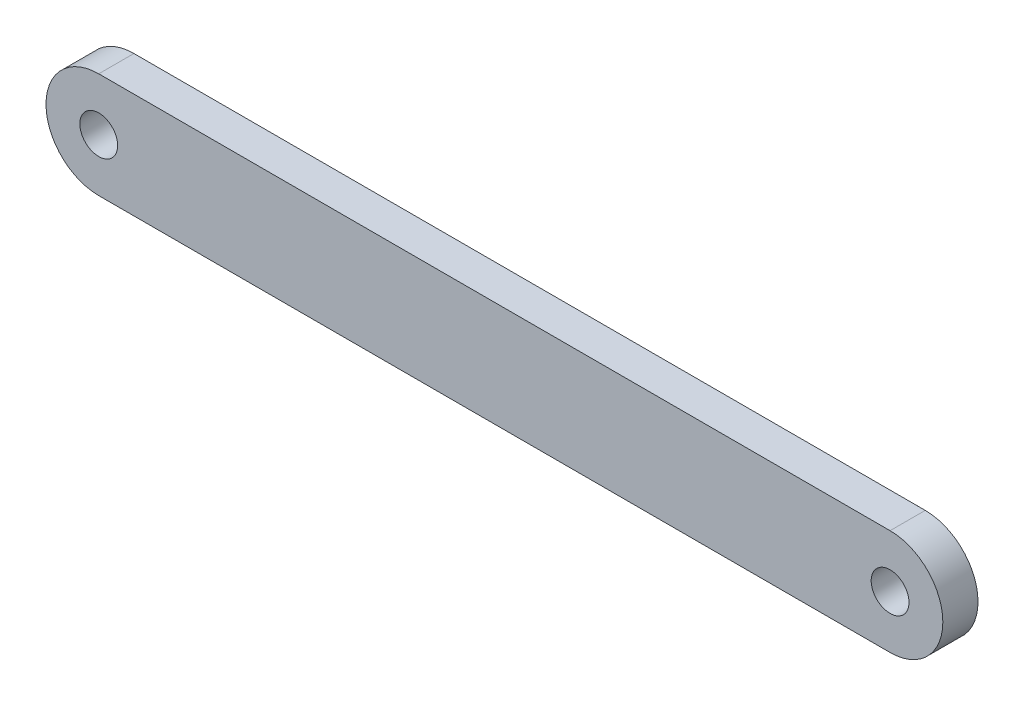
ISO-10303-21;
HEADER;
FILE_DESCRIPTION(('STEP AP214'),'2;1');
FILE_NAME('part.step','',(''),(''),'','','');
FILE_SCHEMA(('AUTOMOTIVE_DESIGN { 1 0 10303 214 1 1 1 1 }'));
ENDSEC;
DATA;
#1=APPLICATION_CONTEXT('core data for automotive mechanical design processes');
#2=APPLICATION_PROTOCOL_DEFINITION('international standard','automotive_design',2000,#1);
#3=PRODUCT_CONTEXT('',#1,'mechanical');
#4=PRODUCT('Part','Part','',(#3));
#5=PRODUCT_RELATED_PRODUCT_CATEGORY('part','',(#4));
#6=PRODUCT_DEFINITION_FORMATION('','',#4);
#7=PRODUCT_DEFINITION_CONTEXT('part definition',#1,'design');
#8=PRODUCT_DEFINITION('design','',#6,#7);
#9=PRODUCT_DEFINITION_SHAPE('','',#8);
#10=(LENGTH_UNIT() NAMED_UNIT(*) SI_UNIT(.MILLI.,.METRE.));
#11=(NAMED_UNIT(*) PLANE_ANGLE_UNIT() SI_UNIT($,.RADIAN.));
#12=(NAMED_UNIT(*) SI_UNIT($,.STERADIAN.) SOLID_ANGLE_UNIT());
#13=UNCERTAINTY_MEASURE_WITH_UNIT(LENGTH_MEASURE(1.E-05),#10,'distance_accuracy_value','');
#14=(GEOMETRIC_REPRESENTATION_CONTEXT(3) GLOBAL_UNCERTAINTY_ASSIGNED_CONTEXT((#13)) GLOBAL_UNIT_ASSIGNED_CONTEXT((#10,
#11,#12)) REPRESENTATION_CONTEXT('',''));
#15=CARTESIAN_POINT('',(0.,0.,0.));
#16=DIRECTION('',(0.,0.,1.));
#17=DIRECTION('',(1.,0.,0.));
#18=AXIS2_PLACEMENT_3D('',#15,#16,#17);
#19=CARTESIAN_POINT('',(0.,0.,4.));
#20=DIRECTION('',(0.,0.,1.));
#21=DIRECTION('',(1.,0.,0.));
#22=AXIS2_PLACEMENT_3D('',#19,#20,#21);
#23=PLANE('',#22);
#24=CARTESIAN_POINT('',(0.,0.,4.));
#25=DIRECTION('',(0.,0.,1.));
#26=DIRECTION('',(1.,0.,0.));
#27=AXIS2_PLACEMENT_3D('',#24,#25,#26);
#28=CIRCLE('',#27,2.15);
#29=CARTESIAN_POINT('',(2.15,0.,4.));
#30=VERTEX_POINT('',#29);
#31=EDGE_CURVE('E104',#30,#30,#28,.T.);
#32=ORIENTED_EDGE('',*,*,#31,.F.);
#33=EDGE_LOOP('',(#32));
#34=FACE_BOUND('',#33,.T.);
#35=CARTESIAN_POINT('',(0.,0.,4.));
#36=DIRECTION('',(0.,0.,1.));
#37=DIRECTION('',(1.,0.,0.));
#38=AXIS2_PLACEMENT_3D('',#35,#36,#37);
#39=CIRCLE('',#38,6.);
#40=CARTESIAN_POINT('',(0.,6.,4.));
#41=VERTEX_POINT('',#40);
#42=CARTESIAN_POINT('',(0.,-6.,4.));
#43=VERTEX_POINT('',#42);
#44=EDGE_CURVE('E89',#41,#43,#39,.T.);
#45=ORIENTED_EDGE('',*,*,#44,.T.);
#46=DIRECTION('',(1.,0.,0.));
#47=VECTOR('',#46,1.);
#48=CARTESIAN_POINT('',(0.,-6.,4.));
#49=LINE('',#48,#47);
#50=CARTESIAN_POINT('',(90.,-6.,4.));
#51=VERTEX_POINT('',#50);
#52=EDGE_CURVE('E84',#43,#51,#49,.T.);
#53=ORIENTED_EDGE('',*,*,#52,.T.);
#54=CARTESIAN_POINT('',(90.,0.,4.));
#55=DIRECTION('',(0.,0.,1.));
#56=DIRECTION('',(1.,0.,0.));
#57=AXIS2_PLACEMENT_3D('',#54,#55,#56);
#58=CIRCLE('',#57,6.);
#59=CARTESIAN_POINT('',(90.,6.,4.));
#60=VERTEX_POINT('',#59);
#61=EDGE_CURVE('E87',#51,#60,#58,.T.);
#62=ORIENTED_EDGE('',*,*,#61,.T.);
#63=DIRECTION('',(-1.,0.,0.));
#64=VECTOR('',#63,1.);
#65=CARTESIAN_POINT('',(0.,6.,4.));
#66=LINE('',#65,#64);
#67=EDGE_CURVE('E54',#60,#41,#66,.T.);
#68=ORIENTED_EDGE('',*,*,#67,.T.);
#69=EDGE_LOOP('',(#45,#53,#62,#68));
#70=FACE_BOUND('',#69,.T.);
#71=CARTESIAN_POINT('',(90.,0.,4.));
#72=DIRECTION('',(0.,0.,1.));
#73=DIRECTION('',(1.,0.,0.));
#74=AXIS2_PLACEMENT_3D('',#71,#72,#73);
#75=CIRCLE('',#74,2.15);
#76=CARTESIAN_POINT('',(92.15,0.,4.));
#77=VERTEX_POINT('',#76);
#78=EDGE_CURVE('E119',#77,#77,#75,.T.);
#79=ORIENTED_EDGE('',*,*,#78,.F.);
#80=EDGE_LOOP('',(#79));
#81=FACE_BOUND('',#80,.T.);
#82=ADVANCED_FACE('F37',(#34,#70,#81),#23,.T.);
#83=CARTESIAN_POINT('',(0.,0.,0.));
#84=DIRECTION('',(0.,0.,1.));
#85=DIRECTION('',(1.,0.,0.));
#86=AXIS2_PLACEMENT_3D('',#83,#84,#85);
#87=PLANE('',#86);
#88=CARTESIAN_POINT('',(0.,0.,0.));
#89=DIRECTION('',(0.,0.,1.));
#90=DIRECTION('',(1.,0.,0.));
#91=AXIS2_PLACEMENT_3D('',#88,#89,#90);
#92=CIRCLE('',#91,6.);
#93=CARTESIAN_POINT('',(0.,6.,0.));
#94=VERTEX_POINT('',#93);
#95=CARTESIAN_POINT('',(0.,-6.,0.));
#96=VERTEX_POINT('',#95);
#97=EDGE_CURVE('E101',#94,#96,#92,.T.);
#98=ORIENTED_EDGE('',*,*,#97,.F.);
#99=DIRECTION('',(-1.,0.,0.));
#100=VECTOR('',#99,1.);
#101=CARTESIAN_POINT('',(0.,6.,0.));
#102=LINE('',#101,#100);
#103=CARTESIAN_POINT('',(90.,6.,0.));
#104=VERTEX_POINT('',#103);
#105=EDGE_CURVE('E77',#104,#94,#102,.T.);
#106=ORIENTED_EDGE('',*,*,#105,.F.);
#107=CARTESIAN_POINT('',(90.,0.,0.));
#108=DIRECTION('',(0.,0.,1.));
#109=DIRECTION('',(1.,0.,0.));
#110=AXIS2_PLACEMENT_3D('',#107,#108,#109);
#111=CIRCLE('',#110,6.);
#112=CARTESIAN_POINT('',(90.,-6.,0.));
#113=VERTEX_POINT('',#112);
#114=EDGE_CURVE('E71',#113,#104,#111,.T.);
#115=ORIENTED_EDGE('',*,*,#114,.F.);
#116=DIRECTION('',(1.,0.,0.));
#117=VECTOR('',#116,1.);
#118=CARTESIAN_POINT('',(0.,-6.,0.));
#119=LINE('',#118,#117);
#120=EDGE_CURVE('E93',#96,#113,#119,.T.);
#121=ORIENTED_EDGE('',*,*,#120,.F.);
#122=EDGE_LOOP('',(#98,#106,#115,#121));
#123=FACE_BOUND('',#122,.T.);
#124=CARTESIAN_POINT('',(0.,0.,0.));
#125=DIRECTION('',(0.,0.,1.));
#126=DIRECTION('',(1.,0.,0.));
#127=AXIS2_PLACEMENT_3D('',#124,#125,#126);
#128=CIRCLE('',#127,2.15);
#129=CARTESIAN_POINT('',(2.15,0.,0.));
#130=VERTEX_POINT('',#129);
#131=EDGE_CURVE('E116',#130,#130,#128,.T.);
#132=ORIENTED_EDGE('',*,*,#131,.T.);
#133=EDGE_LOOP('',(#132));
#134=FACE_BOUND('',#133,.T.);
#135=CARTESIAN_POINT('',(90.,0.,0.));
#136=DIRECTION('',(0.,0.,1.));
#137=DIRECTION('',(1.,0.,0.));
#138=AXIS2_PLACEMENT_3D('',#135,#136,#137);
#139=CIRCLE('',#138,2.15);
#140=CARTESIAN_POINT('',(92.15,0.,0.));
#141=VERTEX_POINT('',#140);
#142=EDGE_CURVE('E122',#141,#141,#139,.T.);
#143=ORIENTED_EDGE('',*,*,#142,.T.);
#144=EDGE_LOOP('',(#143));
#145=FACE_BOUND('',#144,.T.);
#146=ADVANCED_FACE('F112',(#123,#134,#145),#87,.F.);
#147=CARTESIAN_POINT('',(0.,0.,4.));
#148=DIRECTION('',(0.,0.,-1.));
#149=DIRECTION('',(-1.,0.,0.));
#150=AXIS2_PLACEMENT_3D('',#147,#148,#149);
#151=CYLINDRICAL_SURFACE('',#150,6.);
#152=ORIENTED_EDGE('',*,*,#97,.T.);
#153=DIRECTION('',(0.,0.,-1.));
#154=VECTOR('',#153,1.);
#155=CARTESIAN_POINT('',(0.,-6.,4.));
#156=LINE('',#155,#154);
#157=EDGE_CURVE('E11',#43,#96,#156,.T.);
#158=ORIENTED_EDGE('',*,*,#157,.F.);
#159=ORIENTED_EDGE('',*,*,#44,.F.);
#160=DIRECTION('',(0.,0.,-1.));
#161=VECTOR('',#160,1.);
#162=CARTESIAN_POINT('',(0.,6.,4.));
#163=LINE('',#162,#161);
#164=EDGE_CURVE('E97',#41,#94,#163,.T.);
#165=ORIENTED_EDGE('',*,*,#164,.T.);
#166=EDGE_LOOP('',(#152,#158,#159,#165));
#167=FACE_BOUND('',#166,.T.);
#168=ADVANCED_FACE('F39',(#167),#151,.T.);
#169=CARTESIAN_POINT('',(0.,-6.,4.));
#170=DIRECTION('',(0.,1.,0.));
#171=DIRECTION('',(0.,0.,1.));
#172=AXIS2_PLACEMENT_3D('',#169,#170,#171);
#173=PLANE('',#172);
#174=ORIENTED_EDGE('',*,*,#120,.T.);
#175=DIRECTION('',(0.,0.,-1.));
#176=VECTOR('',#175,1.);
#177=CARTESIAN_POINT('',(90.,-6.,4.));
#178=LINE('',#177,#176);
#179=EDGE_CURVE('E46',#51,#113,#178,.T.);
#180=ORIENTED_EDGE('',*,*,#179,.F.);
#181=ORIENTED_EDGE('',*,*,#52,.F.);
#182=ORIENTED_EDGE('',*,*,#157,.T.);
#183=EDGE_LOOP('',(#174,#180,#181,#182));
#184=FACE_BOUND('',#183,.T.);
#185=ADVANCED_FACE('F92',(#184),#173,.F.);
#186=CARTESIAN_POINT('',(90.,0.,4.));
#187=DIRECTION('',(0.,0.,-1.));
#188=DIRECTION('',(-1.,0.,0.));
#189=AXIS2_PLACEMENT_3D('',#186,#187,#188);
#190=CYLINDRICAL_SURFACE('',#189,6.);
#191=ORIENTED_EDGE('',*,*,#114,.T.);
#192=DIRECTION('',(0.,0.,-1.));
#193=VECTOR('',#192,1.);
#194=CARTESIAN_POINT('',(90.,6.,4.));
#195=LINE('',#194,#193);
#196=EDGE_CURVE('E94',#60,#104,#195,.T.);
#197=ORIENTED_EDGE('',*,*,#196,.F.);
#198=ORIENTED_EDGE('',*,*,#61,.F.);
#199=ORIENTED_EDGE('',*,*,#179,.T.);
#200=EDGE_LOOP('',(#191,#197,#198,#199));
#201=FACE_BOUND('',#200,.T.);
#202=ADVANCED_FACE('F95',(#201),#190,.T.);
#203=CARTESIAN_POINT('',(0.,6.,4.));
#204=DIRECTION('',(0.,-1.,0.));
#205=DIRECTION('',(0.,0.,-1.));
#206=AXIS2_PLACEMENT_3D('',#203,#204,#205);
#207=PLANE('',#206);
#208=ORIENTED_EDGE('',*,*,#105,.T.);
#209=ORIENTED_EDGE('',*,*,#164,.F.);
#210=ORIENTED_EDGE('',*,*,#67,.F.);
#211=ORIENTED_EDGE('',*,*,#196,.T.);
#212=EDGE_LOOP('',(#208,#209,#210,#211));
#213=FACE_BOUND('',#212,.T.);
#214=ADVANCED_FACE('F109',(#213),#207,.F.);
#215=CARTESIAN_POINT('',(0.,0.,4.));
#216=DIRECTION('',(0.,0.,-1.));
#217=DIRECTION('',(-1.,0.,0.));
#218=AXIS2_PLACEMENT_3D('',#215,#216,#217);
#219=CYLINDRICAL_SURFACE('',#218,2.15);
#220=ORIENTED_EDGE('',*,*,#31,.T.);
#221=EDGE_LOOP('',(#220));
#222=FACE_BOUND('',#221,.T.);
#223=ORIENTED_EDGE('',*,*,#131,.F.);
#224=EDGE_LOOP('',(#223));
#225=FACE_BOUND('',#224,.T.);
#226=ADVANCED_FACE('F139',(#222,#225),#219,.F.);
#227=CARTESIAN_POINT('',(90.,0.,4.));
#228=DIRECTION('',(0.,0.,-1.));
#229=DIRECTION('',(-1.,0.,0.));
#230=AXIS2_PLACEMENT_3D('',#227,#228,#229);
#231=CYLINDRICAL_SURFACE('',#230,2.15);
#232=ORIENTED_EDGE('',*,*,#78,.T.);
#233=EDGE_LOOP('',(#232));
#234=FACE_BOUND('',#233,.T.);
#235=ORIENTED_EDGE('',*,*,#142,.F.);
#236=EDGE_LOOP('',(#235));
#237=FACE_BOUND('',#236,.T.);
#238=ADVANCED_FACE('F128',(#234,#237),#231,.F.);
#239=CLOSED_SHELL('',(#82,#146,#168,#185,#202,#214,#226,#238));
#240=MANIFOLD_SOLID_BREP('B2',#239);
#241=ADVANCED_BREP_SHAPE_REPRESENTATION('',(#18,#240),#14);
#242=SHAPE_DEFINITION_REPRESENTATION(#9,#241);
ENDSEC;
END-ISO-10303-21;
